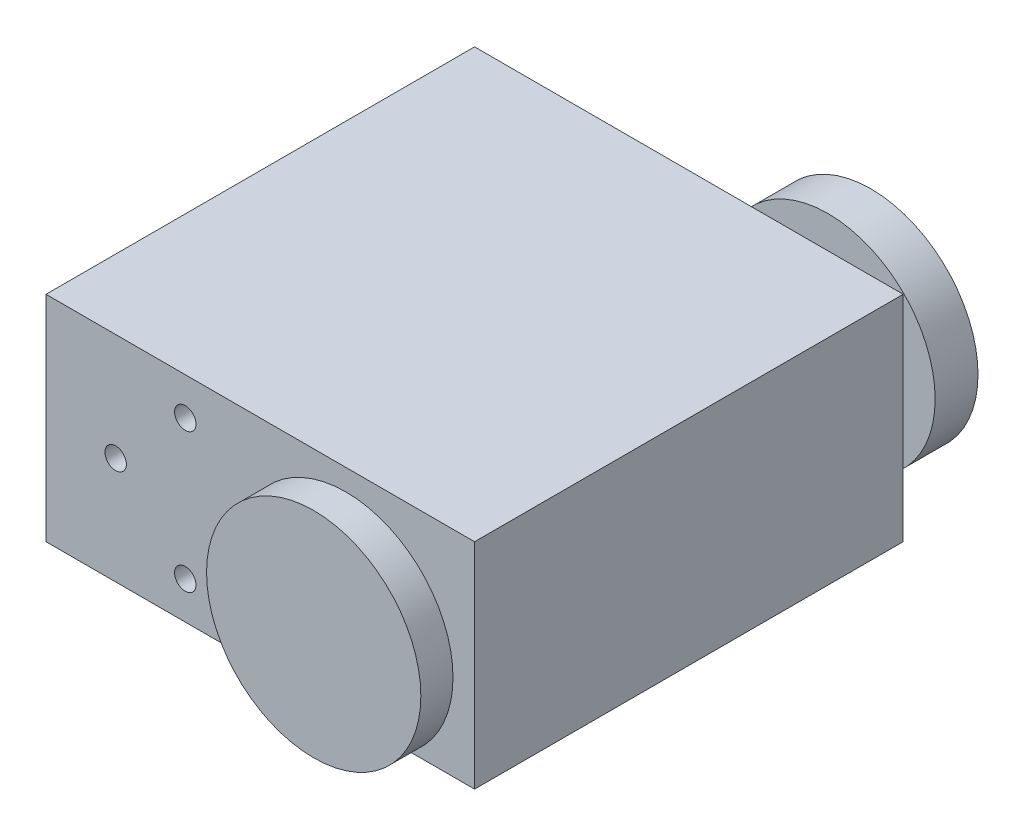
ISO-10303-21;
HEADER;
FILE_DESCRIPTION(('STEP AP214'),'2;1');
FILE_NAME('part.step','',(''),(''),'','','');
FILE_SCHEMA(('AUTOMOTIVE_DESIGN { 1 0 10303 214 1 1 1 1 }'));
ENDSEC;
DATA;
#1=APPLICATION_CONTEXT('core data for automotive mechanical design processes');
#2=APPLICATION_PROTOCOL_DEFINITION('international standard','automotive_design',2000,#1);
#3=PRODUCT_CONTEXT('',#1,'mechanical');
#4=PRODUCT('Part','Part','',(#3));
#5=PRODUCT_RELATED_PRODUCT_CATEGORY('part','',(#4));
#6=PRODUCT_DEFINITION_FORMATION('','',#4);
#7=PRODUCT_DEFINITION_CONTEXT('part definition',#1,'design');
#8=PRODUCT_DEFINITION('design','',#6,#7);
#9=PRODUCT_DEFINITION_SHAPE('','',#8);
#10=(LENGTH_UNIT() NAMED_UNIT(*) SI_UNIT(.MILLI.,.METRE.));
#11=(NAMED_UNIT(*) PLANE_ANGLE_UNIT() SI_UNIT($,.RADIAN.));
#12=(NAMED_UNIT(*) SI_UNIT($,.STERADIAN.) SOLID_ANGLE_UNIT());
#13=UNCERTAINTY_MEASURE_WITH_UNIT(LENGTH_MEASURE(1.E-05),#10,'distance_accuracy_value','');
#14=(GEOMETRIC_REPRESENTATION_CONTEXT(3) GLOBAL_UNCERTAINTY_ASSIGNED_CONTEXT((#13)) GLOBAL_UNIT_ASSIGNED_CONTEXT((#10,
#11,#12)) REPRESENTATION_CONTEXT('',''));
#15=CARTESIAN_POINT('',(0.,0.,0.));
#16=DIRECTION('',(0.,0.,1.));
#17=DIRECTION('',(1.,0.,0.));
#18=AXIS2_PLACEMENT_3D('',#15,#16,#17);
#19=CARTESIAN_POINT('',(0.,20.,0.));
#20=DIRECTION('',(1.,0.,0.));
#21=DIRECTION('',(0.,0.,-1.));
#22=AXIS2_PLACEMENT_3D('',#19,#20,#21);
#23=PLANE('',#22);
#24=DIRECTION('',(0.,0.,1.));
#25=VECTOR('',#24,1.);
#26=CARTESIAN_POINT('',(0.,0.,0.));
#27=LINE('',#26,#25);
#28=CARTESIAN_POINT('',(0.,0.,-40.));
#29=VERTEX_POINT('',#28);
#30=CARTESIAN_POINT('',(0.,0.,0.));
#31=VERTEX_POINT('',#30);
#32=EDGE_CURVE('E97',#29,#31,#27,.T.);
#33=ORIENTED_EDGE('',*,*,#32,.T.);
#34=DIRECTION('',(0.,-1.,0.));
#35=VECTOR('',#34,1.);
#36=CARTESIAN_POINT('',(0.,20.,0.));
#37=LINE('',#36,#35);
#38=CARTESIAN_POINT('',(0.,20.,0.));
#39=VERTEX_POINT('',#38);
#40=EDGE_CURVE('E11',#39,#31,#37,.T.);
#41=ORIENTED_EDGE('',*,*,#40,.F.);
#42=DIRECTION('',(0.,0.,1.));
#43=VECTOR('',#42,1.);
#44=CARTESIAN_POINT('',(0.,20.,0.));
#45=LINE('',#44,#43);
#46=CARTESIAN_POINT('',(0.,20.,-40.));
#47=VERTEX_POINT('',#46);
#48=EDGE_CURVE('E84',#47,#39,#45,.T.);
#49=ORIENTED_EDGE('',*,*,#48,.F.);
#50=DIRECTION('',(0.,-1.,0.));
#51=VECTOR('',#50,1.);
#52=CARTESIAN_POINT('',(0.,20.,-40.));
#53=LINE('',#52,#51);
#54=EDGE_CURVE('E93',#47,#29,#53,.T.);
#55=ORIENTED_EDGE('',*,*,#54,.T.);
#56=EDGE_LOOP('',(#33,#41,#49,#55));
#57=FACE_BOUND('',#56,.T.);
#58=ADVANCED_FACE('F32',(#57),#23,.F.);
#59=CARTESIAN_POINT('',(0.,20.,0.));
#60=DIRECTION('',(0.,0.,-1.));
#61=DIRECTION('',(-1.,0.,0.));
#62=AXIS2_PLACEMENT_3D('',#59,#60,#61);
#63=PLANE('',#62);
#64=CARTESIAN_POINT('',(13.,16.5,0.));
#65=DIRECTION('',(0.,0.,1.));
#66=DIRECTION('',(1.,0.,0.));
#67=AXIS2_PLACEMENT_3D('',#64,#65,#66);
#68=CIRCLE('',#67,1.);
#69=CARTESIAN_POINT('',(14.,16.5,0.));
#70=VERTEX_POINT('',#69);
#71=EDGE_CURVE('E174',#70,#70,#68,.T.);
#72=ORIENTED_EDGE('',*,*,#71,.F.);
#73=EDGE_LOOP('',(#72));
#74=FACE_BOUND('',#73,.T.);
#75=CARTESIAN_POINT('',(6.49999999999998,10.,0.));
#76=DIRECTION('',(0.,0.,1.));
#77=DIRECTION('',(1.,0.,0.));
#78=AXIS2_PLACEMENT_3D('',#75,#76,#77);
#79=CIRCLE('',#78,1.);
#80=CARTESIAN_POINT('',(7.49999999999998,10.,0.));
#81=VERTEX_POINT('',#80);
#82=EDGE_CURVE('E168',#81,#81,#79,.T.);
#83=ORIENTED_EDGE('',*,*,#82,.F.);
#84=EDGE_LOOP('',(#83));
#85=FACE_BOUND('',#84,.T.);
#86=CARTESIAN_POINT('',(13.,3.5,0.));
#87=DIRECTION('',(0.,0.,1.));
#88=DIRECTION('',(1.,0.,0.));
#89=AXIS2_PLACEMENT_3D('',#86,#87,#88);
#90=CIRCLE('',#89,1.);
#91=CARTESIAN_POINT('',(14.,3.5,0.));
#92=VERTEX_POINT('',#91);
#93=EDGE_CURVE('E162',#92,#92,#90,.T.);
#94=ORIENTED_EDGE('',*,*,#93,.F.);
#95=EDGE_LOOP('',(#94));
#96=FACE_BOUND('',#95,.T.);
#97=CARTESIAN_POINT('',(19.5,10.,0.));
#98=DIRECTION('',(0.,0.,1.));
#99=DIRECTION('',(1.,0.,0.));
#100=AXIS2_PLACEMENT_3D('',#97,#98,#99);
#101=CIRCLE('',#100,1.00000000000001);
#102=CARTESIAN_POINT('',(20.5,10.,0.));
#103=VERTEX_POINT('',#102);
#104=EDGE_CURVE('E156',#103,#103,#101,.T.);
#105=ORIENTED_EDGE('',*,*,#104,.F.);
#106=EDGE_LOOP('',(#105));
#107=FACE_BOUND('',#106,.T.);
#108=CARTESIAN_POINT('',(29.9853252116758,10.0202953764466,0.));
#109=DIRECTION('',(0.,0.,-1.));
#110=DIRECTION('',(-1.,0.,0.));
#111=AXIS2_PLACEMENT_3D('',#108,#109,#110);
#112=CIRCLE('',#111,4.);
#113=CARTESIAN_POINT('',(25.9853252116758,10.0202953764466,0.));
#114=VERTEX_POINT('',#113);
#115=EDGE_CURVE('E100',#114,#114,#112,.T.);
#116=ORIENTED_EDGE('',*,*,#115,.T.);
#117=EDGE_LOOP('',(#116));
#118=FACE_BOUND('',#117,.T.);
#119=DIRECTION('',(1.,0.,0.));
#120=VECTOR('',#119,1.);
#121=CARTESIAN_POINT('',(0.,0.,0.));
#122=LINE('',#121,#120);
#123=CARTESIAN_POINT('',(40.,0.,0.));
#124=VERTEX_POINT('',#123);
#125=EDGE_CURVE('E88',#31,#124,#122,.T.);
#126=ORIENTED_EDGE('',*,*,#125,.T.);
#127=DIRECTION('',(0.,-1.,0.));
#128=VECTOR('',#127,1.);
#129=CARTESIAN_POINT('',(40.,20.,0.));
#130=LINE('',#129,#128);
#131=CARTESIAN_POINT('',(40.,20.,0.));
#132=VERTEX_POINT('',#131);
#133=EDGE_CURVE('E41',#132,#124,#130,.T.);
#134=ORIENTED_EDGE('',*,*,#133,.F.);
#135=DIRECTION('',(1.,0.,0.));
#136=VECTOR('',#135,1.);
#137=CARTESIAN_POINT('',(0.,20.,0.));
#138=LINE('',#137,#136);
#139=EDGE_CURVE('E79',#39,#132,#138,.T.);
#140=ORIENTED_EDGE('',*,*,#139,.F.);
#141=ORIENTED_EDGE('',*,*,#40,.T.);
#142=EDGE_LOOP('',(#126,#134,#140,#141));
#143=FACE_BOUND('',#142,.T.);
#144=ADVANCED_FACE('F87',(#74,#85,#96,#107,#118,#143),#63,.F.);
#145=CARTESIAN_POINT('',(40.,20.,0.));
#146=DIRECTION('',(-1.,0.,0.));
#147=DIRECTION('',(0.,0.,1.));
#148=AXIS2_PLACEMENT_3D('',#145,#146,#147);
#149=PLANE('',#148);
#150=DIRECTION('',(0.,0.,-1.));
#151=VECTOR('',#150,1.);
#152=CARTESIAN_POINT('',(40.,0.,0.));
#153=LINE('',#152,#151);
#154=CARTESIAN_POINT('',(40.,0.,-40.));
#155=VERTEX_POINT('',#154);
#156=EDGE_CURVE('E66',#124,#155,#153,.T.);
#157=ORIENTED_EDGE('',*,*,#156,.T.);
#158=DIRECTION('',(0.,-1.,0.));
#159=VECTOR('',#158,1.);
#160=CARTESIAN_POINT('',(40.,20.,-40.));
#161=LINE('',#160,#159);
#162=CARTESIAN_POINT('',(40.,20.,-40.));
#163=VERTEX_POINT('',#162);
#164=EDGE_CURVE('E89',#163,#155,#161,.T.);
#165=ORIENTED_EDGE('',*,*,#164,.F.);
#166=DIRECTION('',(0.,0.,-1.));
#167=VECTOR('',#166,1.);
#168=CARTESIAN_POINT('',(40.,20.,0.));
#169=LINE('',#168,#167);
#170=EDGE_CURVE('E82',#132,#163,#169,.T.);
#171=ORIENTED_EDGE('',*,*,#170,.F.);
#172=ORIENTED_EDGE('',*,*,#133,.T.);
#173=EDGE_LOOP('',(#157,#165,#171,#172));
#174=FACE_BOUND('',#173,.T.);
#175=ADVANCED_FACE('F91',(#174),#149,.F.);
#176=CARTESIAN_POINT('',(0.,20.,-40.));
#177=DIRECTION('',(0.,0.,1.));
#178=DIRECTION('',(1.,0.,0.));
#179=AXIS2_PLACEMENT_3D('',#176,#177,#178);
#180=PLANE('',#179);
#181=CARTESIAN_POINT('',(21.,18.,-40.));
#182=DIRECTION('',(0.,0.,-1.));
#183=DIRECTION('',(-1.,0.,0.));
#184=AXIS2_PLACEMENT_3D('',#181,#182,#183);
#185=CIRCLE('',#184,1.);
#186=CARTESIAN_POINT('',(20.,18.,-40.));
#187=VERTEX_POINT('',#186);
#188=EDGE_CURVE('E138',#187,#187,#185,.T.);
#189=ORIENTED_EDGE('',*,*,#188,.F.);
#190=EDGE_LOOP('',(#189));
#191=FACE_BOUND('',#190,.T.);
#192=CARTESIAN_POINT('',(21.,2.,-40.));
#193=DIRECTION('',(0.,0.,-1.));
#194=DIRECTION('',(-1.,0.,0.));
#195=AXIS2_PLACEMENT_3D('',#192,#193,#194);
#196=CIRCLE('',#195,1.);
#197=CARTESIAN_POINT('',(20.,2.,-40.));
#198=VERTEX_POINT('',#197);
#199=EDGE_CURVE('E145',#198,#198,#196,.T.);
#200=ORIENTED_EDGE('',*,*,#199,.F.);
#201=EDGE_LOOP('',(#200));
#202=FACE_BOUND('',#201,.T.);
#203=CARTESIAN_POINT('',(5.00000000000002,2.,-40.));
#204=DIRECTION('',(0.,0.,-1.));
#205=DIRECTION('',(-1.,0.,0.));
#206=AXIS2_PLACEMENT_3D('',#203,#204,#205);
#207=CIRCLE('',#206,1.);
#208=CARTESIAN_POINT('',(4.00000000000002,2.,-40.));
#209=VERTEX_POINT('',#208);
#210=EDGE_CURVE('E151',#209,#209,#207,.T.);
#211=ORIENTED_EDGE('',*,*,#210,.F.);
#212=EDGE_LOOP('',(#211));
#213=FACE_BOUND('',#212,.T.);
#214=CARTESIAN_POINT('',(5.00000000000002,18.,-40.));
#215=DIRECTION('',(0.,0.,-1.));
#216=DIRECTION('',(-1.,0.,0.));
#217=AXIS2_PLACEMENT_3D('',#214,#215,#216);
#218=CIRCLE('',#217,1.);
#219=CARTESIAN_POINT('',(4.00000000000002,18.,-40.));
#220=VERTEX_POINT('',#219);
#221=EDGE_CURVE('E132',#220,#220,#218,.T.);
#222=ORIENTED_EDGE('',*,*,#221,.F.);
#223=EDGE_LOOP('',(#222));
#224=FACE_BOUND('',#223,.T.);
#225=CARTESIAN_POINT('',(29.9853252116758,10.0202953764466,-40.));
#226=DIRECTION('',(0.,0.,1.));
#227=DIRECTION('',(1.,0.,0.));
#228=AXIS2_PLACEMENT_3D('',#225,#226,#227);
#229=CIRCLE('',#228,4.);
#230=CARTESIAN_POINT('',(33.9853252116758,10.0202953764466,-40.));
#231=VERTEX_POINT('',#230);
#232=EDGE_CURVE('E35',#231,#231,#229,.T.);
#233=ORIENTED_EDGE('',*,*,#232,.T.);
#234=EDGE_LOOP('',(#233));
#235=FACE_BOUND('',#234,.T.);
#236=DIRECTION('',(-1.,0.,0.));
#237=VECTOR('',#236,1.);
#238=CARTESIAN_POINT('',(0.,0.,-40.));
#239=LINE('',#238,#237);
#240=EDGE_CURVE('E72',#155,#29,#239,.T.);
#241=ORIENTED_EDGE('',*,*,#240,.T.);
#242=ORIENTED_EDGE('',*,*,#54,.F.);
#243=DIRECTION('',(-1.,0.,0.));
#244=VECTOR('',#243,1.);
#245=CARTESIAN_POINT('',(0.,20.,-40.));
#246=LINE('',#245,#244);
#247=EDGE_CURVE('E49',#163,#47,#246,.T.);
#248=ORIENTED_EDGE('',*,*,#247,.F.);
#249=ORIENTED_EDGE('',*,*,#164,.T.);
#250=EDGE_LOOP('',(#241,#242,#248,#249));
#251=FACE_BOUND('',#250,.T.);
#252=ADVANCED_FACE('F105',(#191,#202,#213,#224,#235,#251),#180,.F.);
#253=CARTESIAN_POINT('',(0.,20.,0.));
#254=DIRECTION('',(0.,-1.,0.));
#255=DIRECTION('',(0.,0.,-1.));
#256=AXIS2_PLACEMENT_3D('',#253,#254,#255);
#257=PLANE('',#256);
#258=ORIENTED_EDGE('',*,*,#48,.T.);
#259=ORIENTED_EDGE('',*,*,#139,.T.);
#260=ORIENTED_EDGE('',*,*,#170,.T.);
#261=ORIENTED_EDGE('',*,*,#247,.T.);
#262=EDGE_LOOP('',(#258,#259,#260,#261));
#263=FACE_BOUND('',#262,.T.);
#264=ADVANCED_FACE('F80',(#263),#257,.F.);
#265=CARTESIAN_POINT('',(0.,0.,0.));
#266=DIRECTION('',(0.,-1.,0.));
#267=DIRECTION('',(0.,0.,-1.));
#268=AXIS2_PLACEMENT_3D('',#265,#266,#267);
#269=PLANE('',#268);
#270=ORIENTED_EDGE('',*,*,#32,.F.);
#271=ORIENTED_EDGE('',*,*,#240,.F.);
#272=ORIENTED_EDGE('',*,*,#156,.F.);
#273=ORIENTED_EDGE('',*,*,#125,.F.);
#274=EDGE_LOOP('',(#270,#271,#272,#273));
#275=FACE_BOUND('',#274,.T.);
#276=ADVANCED_FACE('F108',(#275),#269,.T.);
#277=CARTESIAN_POINT('',(29.9853252116758,10.0202953764466,-43.));
#278=DIRECTION('',(0.,0.,1.));
#279=DIRECTION('',(1.,0.,0.));
#280=AXIS2_PLACEMENT_3D('',#277,#278,#279);
#281=CYLINDRICAL_SURFACE('',#280,4.);
#282=CARTESIAN_POINT('',(29.9853252116758,10.0202953764466,-43.));
#283=DIRECTION('',(0.,0.,1.));
#284=DIRECTION('',(1.,0.,0.));
#285=AXIS2_PLACEMENT_3D('',#282,#283,#284);
#286=CIRCLE('',#285,4.);
#287=CARTESIAN_POINT('',(33.9853252116758,10.0202953764466,-43.));
#288=VERTEX_POINT('',#287);
#289=EDGE_CURVE('E113',#288,#288,#286,.T.);
#290=ORIENTED_EDGE('',*,*,#289,.T.);
#291=EDGE_LOOP('',(#290));
#292=FACE_BOUND('',#291,.T.);
#293=ORIENTED_EDGE('',*,*,#232,.F.);
#294=EDGE_LOOP('',(#293));
#295=FACE_BOUND('',#294,.T.);
#296=ADVANCED_FACE('F202',(#292,#295),#281,.T.);
#297=CARTESIAN_POINT('',(29.9853252116758,10.0202953764466,2.));
#298=DIRECTION('',(0.,0.,1.));
#299=DIRECTION('',(1.,0.,0.));
#300=AXIS2_PLACEMENT_3D('',#297,#298,#299);
#301=CIRCLE('',#300,4.);
#302=CARTESIAN_POINT('',(33.9853252116758,10.0202953764466,2.));
#303=VERTEX_POINT('',#302);
#304=EDGE_CURVE('E118',#303,#303,#301,.T.);
#305=ORIENTED_EDGE('',*,*,#304,.F.);
#306=EDGE_LOOP('',(#305));
#307=FACE_BOUND('',#306,.T.);
#308=ORIENTED_EDGE('',*,*,#115,.F.);
#309=EDGE_LOOP('',(#308));
#310=FACE_BOUND('',#309,.T.);
#311=ADVANCED_FACE('F199',(#307,#310),#281,.T.);
#312=CARTESIAN_POINT('',(29.9853252116758,10.0202953764466,5.));
#313=DIRECTION('',(0.,0.,-1.));
#314=DIRECTION('',(-1.,0.,0.));
#315=AXIS2_PLACEMENT_3D('',#312,#313,#314);
#316=CYLINDRICAL_SURFACE('',#315,10.);
#317=CARTESIAN_POINT('',(29.9853252116758,10.0202953764466,5.));
#318=DIRECTION('',(0.,0.,1.));
#319=DIRECTION('',(1.,0.,0.));
#320=AXIS2_PLACEMENT_3D('',#317,#318,#319);
#321=CIRCLE('',#320,10.);
#322=CARTESIAN_POINT('',(39.9853252116758,10.0202953764466,5.));
#323=VERTEX_POINT('',#322);
#324=EDGE_CURVE('E121',#323,#323,#321,.T.);
#325=ORIENTED_EDGE('',*,*,#324,.F.);
#326=EDGE_LOOP('',(#325));
#327=FACE_BOUND('',#326,.T.);
#328=CARTESIAN_POINT('',(29.9853252116758,10.0202953764466,2.));
#329=DIRECTION('',(0.,0.,1.));
#330=DIRECTION('',(1.,0.,0.));
#331=AXIS2_PLACEMENT_3D('',#328,#329,#330);
#332=CIRCLE('',#331,10.);
#333=CARTESIAN_POINT('',(39.9853252116758,10.0202953764466,2.));
#334=VERTEX_POINT('',#333);
#335=EDGE_CURVE('E116',#334,#334,#332,.T.);
#336=ORIENTED_EDGE('',*,*,#335,.T.);
#337=EDGE_LOOP('',(#336));
#338=FACE_BOUND('',#337,.T.);
#339=ADVANCED_FACE('F201',(#327,#338),#316,.T.);
#340=CARTESIAN_POINT('',(29.9853252116758,10.0202953764466,5.));
#341=DIRECTION('',(0.,0.,1.));
#342=DIRECTION('',(1.,0.,0.));
#343=AXIS2_PLACEMENT_3D('',#340,#341,#342);
#344=PLANE('',#343);
#345=ORIENTED_EDGE('',*,*,#324,.T.);
#346=EDGE_LOOP('',(#345));
#347=FACE_BOUND('',#346,.T.);
#348=ADVANCED_FACE('F209',(#347),#344,.T.);
#349=CARTESIAN_POINT('',(29.9853252116758,10.0202953764466,2.));
#350=DIRECTION('',(0.,0.,1.));
#351=DIRECTION('',(1.,0.,0.));
#352=AXIS2_PLACEMENT_3D('',#349,#350,#351);
#353=PLANE('',#352);
#354=ORIENTED_EDGE('',*,*,#304,.T.);
#355=EDGE_LOOP('',(#354));
#356=FACE_BOUND('',#355,.T.);
#357=ORIENTED_EDGE('',*,*,#335,.F.);
#358=EDGE_LOOP('',(#357));
#359=FACE_BOUND('',#358,.T.);
#360=ADVANCED_FACE('F273',(#356,#359),#353,.F.);
#361=CARTESIAN_POINT('',(29.9853252116758,10.0202953764466,-47.));
#362=DIRECTION('',(0.,0.,1.));
#363=DIRECTION('',(1.,0.,0.));
#364=AXIS2_PLACEMENT_3D('',#361,#362,#363);
#365=CYLINDRICAL_SURFACE('',#364,10.);
#366=CARTESIAN_POINT('',(29.9853252116758,10.0202953764466,-47.));
#367=DIRECTION('',(0.,0.,-1.));
#368=DIRECTION('',(-1.,0.,0.));
#369=AXIS2_PLACEMENT_3D('',#366,#367,#368);
#370=CIRCLE('',#369,10.);
#371=CARTESIAN_POINT('',(19.9853252116758,10.0202953764466,-47.));
#372=VERTEX_POINT('',#371);
#373=EDGE_CURVE('E117',#372,#372,#370,.T.);
#374=ORIENTED_EDGE('',*,*,#373,.F.);
#375=EDGE_LOOP('',(#374));
#376=FACE_BOUND('',#375,.T.);
#377=CARTESIAN_POINT('',(29.9853252116758,10.0202953764466,-43.));
#378=DIRECTION('',(0.,0.,-1.));
#379=DIRECTION('',(-1.,0.,0.));
#380=AXIS2_PLACEMENT_3D('',#377,#378,#379);
#381=CIRCLE('',#380,10.);
#382=CARTESIAN_POINT('',(19.9853252116758,10.0202953764466,-43.));
#383=VERTEX_POINT('',#382);
#384=EDGE_CURVE('E126',#383,#383,#381,.T.);
#385=ORIENTED_EDGE('',*,*,#384,.T.);
#386=EDGE_LOOP('',(#385));
#387=FACE_BOUND('',#386,.T.);
#388=ADVANCED_FACE('F283',(#376,#387),#365,.T.);
#389=CARTESIAN_POINT('',(29.9853252116758,10.0202953764466,-47.));
#390=DIRECTION('',(0.,0.,-1.));
#391=DIRECTION('',(-1.,0.,0.));
#392=AXIS2_PLACEMENT_3D('',#389,#390,#391);
#393=PLANE('',#392);
#394=ORIENTED_EDGE('',*,*,#373,.T.);
#395=EDGE_LOOP('',(#394));
#396=FACE_BOUND('',#395,.T.);
#397=ADVANCED_FACE('F293',(#396),#393,.T.);
#398=CARTESIAN_POINT('',(29.9853252116758,10.0202953764466,-43.));
#399=DIRECTION('',(0.,0.,-1.));
#400=DIRECTION('',(-1.,0.,0.));
#401=AXIS2_PLACEMENT_3D('',#398,#399,#400);
#402=PLANE('',#401);
#403=ORIENTED_EDGE('',*,*,#289,.F.);
#404=EDGE_LOOP('',(#403));
#405=FACE_BOUND('',#404,.T.);
#406=ORIENTED_EDGE('',*,*,#384,.F.);
#407=EDGE_LOOP('',(#406));
#408=FACE_BOUND('',#407,.T.);
#409=ADVANCED_FACE('F302',(#405,#408),#402,.F.);
#410=CARTESIAN_POINT('',(5.00000000000002,18.,-35.));
#411=DIRECTION('',(0.,0.,-1.));
#412=DIRECTION('',(-1.,0.,0.));
#413=AXIS2_PLACEMENT_3D('',#410,#411,#412);
#414=CYLINDRICAL_SURFACE('',#413,1.);
#415=CARTESIAN_POINT('',(5.00000000000002,18.,-35.));
#416=DIRECTION('',(0.,0.,-1.));
#417=DIRECTION('',(-1.,0.,0.));
#418=AXIS2_PLACEMENT_3D('',#415,#416,#417);
#419=CIRCLE('',#418,1.);
#420=CARTESIAN_POINT('',(4.00000000000002,18.,-35.));
#421=VERTEX_POINT('',#420);
#422=EDGE_CURVE('E129',#421,#421,#419,.T.);
#423=ORIENTED_EDGE('',*,*,#422,.F.);
#424=EDGE_LOOP('',(#423));
#425=FACE_BOUND('',#424,.T.);
#426=ORIENTED_EDGE('',*,*,#221,.T.);
#427=EDGE_LOOP('',(#426));
#428=FACE_BOUND('',#427,.T.);
#429=ADVANCED_FACE('F311',(#425,#428),#414,.F.);
#430=CARTESIAN_POINT('',(5.00000000000002,18.,-35.));
#431=DIRECTION('',(0.,0.,-1.));
#432=DIRECTION('',(-1.,0.,0.));
#433=AXIS2_PLACEMENT_3D('',#430,#431,#432);
#434=PLANE('',#433);
#435=ORIENTED_EDGE('',*,*,#422,.T.);
#436=EDGE_LOOP('',(#435));
#437=FACE_BOUND('',#436,.T.);
#438=ADVANCED_FACE('F321',(#437),#434,.T.);
#439=CARTESIAN_POINT('',(5.00000000000002,2.,-35.));
#440=DIRECTION('',(0.,0.,-1.));
#441=DIRECTION('',(-1.,0.,0.));
#442=AXIS2_PLACEMENT_3D('',#439,#440,#441);
#443=CYLINDRICAL_SURFACE('',#442,1.);
#444=CARTESIAN_POINT('',(5.00000000000002,2.,-35.));
#445=DIRECTION('',(0.,0.,-1.));
#446=DIRECTION('',(-1.,0.,0.));
#447=AXIS2_PLACEMENT_3D('',#444,#445,#446);
#448=CIRCLE('',#447,1.);
#449=CARTESIAN_POINT('',(4.00000000000002,2.,-35.));
#450=VERTEX_POINT('',#449);
#451=EDGE_CURVE('E135',#450,#450,#448,.T.);
#452=ORIENTED_EDGE('',*,*,#451,.F.);
#453=EDGE_LOOP('',(#452));
#454=FACE_BOUND('',#453,.T.);
#455=ORIENTED_EDGE('',*,*,#210,.T.);
#456=EDGE_LOOP('',(#455));
#457=FACE_BOUND('',#456,.T.);
#458=ADVANCED_FACE('F328',(#454,#457),#443,.F.);
#459=CARTESIAN_POINT('',(5.00000000000002,2.,-35.));
#460=DIRECTION('',(0.,0.,-1.));
#461=DIRECTION('',(-1.,0.,0.));
#462=AXIS2_PLACEMENT_3D('',#459,#460,#461);
#463=PLANE('',#462);
#464=ORIENTED_EDGE('',*,*,#451,.T.);
#465=EDGE_LOOP('',(#464));
#466=FACE_BOUND('',#465,.T.);
#467=ADVANCED_FACE('F336',(#466),#463,.T.);
#468=CARTESIAN_POINT('',(21.,2.,-35.));
#469=DIRECTION('',(0.,0.,-1.));
#470=DIRECTION('',(-1.,0.,0.));
#471=AXIS2_PLACEMENT_3D('',#468,#469,#470);
#472=CYLINDRICAL_SURFACE('',#471,1.);
#473=CARTESIAN_POINT('',(21.,2.,-35.));
#474=DIRECTION('',(0.,0.,-1.));
#475=DIRECTION('',(-1.,0.,0.));
#476=AXIS2_PLACEMENT_3D('',#473,#474,#475);
#477=CIRCLE('',#476,1.);
#478=CARTESIAN_POINT('',(20.,2.,-35.));
#479=VERTEX_POINT('',#478);
#480=EDGE_CURVE('E148',#479,#479,#477,.T.);
#481=ORIENTED_EDGE('',*,*,#480,.F.);
#482=EDGE_LOOP('',(#481));
#483=FACE_BOUND('',#482,.T.);
#484=ORIENTED_EDGE('',*,*,#199,.T.);
#485=EDGE_LOOP('',(#484));
#486=FACE_BOUND('',#485,.T.);
#487=ADVANCED_FACE('F344',(#483,#486),#472,.F.);
#488=CARTESIAN_POINT('',(21.,2.,-35.));
#489=DIRECTION('',(0.,0.,-1.));
#490=DIRECTION('',(-1.,0.,0.));
#491=AXIS2_PLACEMENT_3D('',#488,#489,#490);
#492=PLANE('',#491);
#493=ORIENTED_EDGE('',*,*,#480,.T.);
#494=EDGE_LOOP('',(#493));
#495=FACE_BOUND('',#494,.T.);
#496=ADVANCED_FACE('F352',(#495),#492,.T.);
#497=CARTESIAN_POINT('',(21.,18.,-35.));
#498=DIRECTION('',(0.,0.,-1.));
#499=DIRECTION('',(-1.,0.,0.));
#500=AXIS2_PLACEMENT_3D('',#497,#498,#499);
#501=CYLINDRICAL_SURFACE('',#500,1.);
#502=CARTESIAN_POINT('',(21.,18.,-35.));
#503=DIRECTION('',(0.,0.,-1.));
#504=DIRECTION('',(-1.,0.,0.));
#505=AXIS2_PLACEMENT_3D('',#502,#503,#504);
#506=CIRCLE('',#505,1.);
#507=CARTESIAN_POINT('',(20.,18.,-35.));
#508=VERTEX_POINT('',#507);
#509=EDGE_CURVE('E141',#508,#508,#506,.T.);
#510=ORIENTED_EDGE('',*,*,#509,.F.);
#511=EDGE_LOOP('',(#510));
#512=FACE_BOUND('',#511,.T.);
#513=ORIENTED_EDGE('',*,*,#188,.T.);
#514=EDGE_LOOP('',(#513));
#515=FACE_BOUND('',#514,.T.);
#516=ADVANCED_FACE('F360',(#512,#515),#501,.F.);
#517=CARTESIAN_POINT('',(21.,18.,-35.));
#518=DIRECTION('',(0.,0.,-1.));
#519=DIRECTION('',(-1.,0.,0.));
#520=AXIS2_PLACEMENT_3D('',#517,#518,#519);
#521=PLANE('',#520);
#522=ORIENTED_EDGE('',*,*,#509,.T.);
#523=EDGE_LOOP('',(#522));
#524=FACE_BOUND('',#523,.T.);
#525=ADVANCED_FACE('F368',(#524),#521,.T.);
#526=CARTESIAN_POINT('',(19.5,10.,-5.));
#527=DIRECTION('',(0.,0.,1.));
#528=DIRECTION('',(1.,0.,0.));
#529=AXIS2_PLACEMENT_3D('',#526,#527,#528);
#530=CYLINDRICAL_SURFACE('',#529,1.00000000000001);
#531=CARTESIAN_POINT('',(19.5,10.,-5.));
#532=DIRECTION('',(0.,0.,1.));
#533=DIRECTION('',(1.,0.,0.));
#534=AXIS2_PLACEMENT_3D('',#531,#532,#533);
#535=CIRCLE('',#534,1.00000000000001);
#536=CARTESIAN_POINT('',(20.5,10.,-5.));
#537=VERTEX_POINT('',#536);
#538=EDGE_CURVE('E159',#537,#537,#535,.T.);
#539=ORIENTED_EDGE('',*,*,#538,.F.);
#540=EDGE_LOOP('',(#539));
#541=FACE_BOUND('',#540,.T.);
#542=ORIENTED_EDGE('',*,*,#104,.T.);
#543=EDGE_LOOP('',(#542));
#544=FACE_BOUND('',#543,.T.);
#545=ADVANCED_FACE('F375',(#541,#544),#530,.F.);
#546=CARTESIAN_POINT('',(19.5,10.,-5.));
#547=DIRECTION('',(0.,0.,1.));
#548=DIRECTION('',(1.,0.,0.));
#549=AXIS2_PLACEMENT_3D('',#546,#547,#548);
#550=PLANE('',#549);
#551=ORIENTED_EDGE('',*,*,#538,.T.);
#552=EDGE_LOOP('',(#551));
#553=FACE_BOUND('',#552,.T.);
#554=ADVANCED_FACE('F382',(#553),#550,.T.);
#555=CARTESIAN_POINT('',(13.,3.5,-5.));
#556=DIRECTION('',(0.,0.,1.));
#557=DIRECTION('',(1.,0.,0.));
#558=AXIS2_PLACEMENT_3D('',#555,#556,#557);
#559=CYLINDRICAL_SURFACE('',#558,1.);
#560=CARTESIAN_POINT('',(13.,3.5,-5.));
#561=DIRECTION('',(0.,0.,1.));
#562=DIRECTION('',(1.,0.,0.));
#563=AXIS2_PLACEMENT_3D('',#560,#561,#562);
#564=CIRCLE('',#563,1.);
#565=CARTESIAN_POINT('',(14.,3.5,-5.));
#566=VERTEX_POINT('',#565);
#567=EDGE_CURVE('E165',#566,#566,#564,.T.);
#568=ORIENTED_EDGE('',*,*,#567,.F.);
#569=EDGE_LOOP('',(#568));
#570=FACE_BOUND('',#569,.T.);
#571=ORIENTED_EDGE('',*,*,#93,.T.);
#572=EDGE_LOOP('',(#571));
#573=FACE_BOUND('',#572,.T.);
#574=ADVANCED_FACE('F390',(#570,#573),#559,.F.);
#575=CARTESIAN_POINT('',(13.,3.5,-5.));
#576=DIRECTION('',(0.,0.,1.));
#577=DIRECTION('',(1.,0.,0.));
#578=AXIS2_PLACEMENT_3D('',#575,#576,#577);
#579=PLANE('',#578);
#580=ORIENTED_EDGE('',*,*,#567,.T.);
#581=EDGE_LOOP('',(#580));
#582=FACE_BOUND('',#581,.T.);
#583=ADVANCED_FACE('F398',(#582),#579,.T.);
#584=CARTESIAN_POINT('',(6.49999999999998,10.,-5.));
#585=DIRECTION('',(0.,0.,1.));
#586=DIRECTION('',(1.,0.,0.));
#587=AXIS2_PLACEMENT_3D('',#584,#585,#586);
#588=CYLINDRICAL_SURFACE('',#587,1.);
#589=CARTESIAN_POINT('',(6.49999999999998,10.,-5.));
#590=DIRECTION('',(0.,0.,1.));
#591=DIRECTION('',(1.,0.,0.));
#592=AXIS2_PLACEMENT_3D('',#589,#590,#591);
#593=CIRCLE('',#592,1.);
#594=CARTESIAN_POINT('',(7.49999999999998,10.,-5.));
#595=VERTEX_POINT('',#594);
#596=EDGE_CURVE('E171',#595,#595,#593,.T.);
#597=ORIENTED_EDGE('',*,*,#596,.F.);
#598=EDGE_LOOP('',(#597));
#599=FACE_BOUND('',#598,.T.);
#600=ORIENTED_EDGE('',*,*,#82,.T.);
#601=EDGE_LOOP('',(#600));
#602=FACE_BOUND('',#601,.T.);
#603=ADVANCED_FACE('F406',(#599,#602),#588,.F.);
#604=CARTESIAN_POINT('',(6.49999999999998,10.,-5.));
#605=DIRECTION('',(0.,0.,1.));
#606=DIRECTION('',(1.,0.,0.));
#607=AXIS2_PLACEMENT_3D('',#604,#605,#606);
#608=PLANE('',#607);
#609=ORIENTED_EDGE('',*,*,#596,.T.);
#610=EDGE_LOOP('',(#609));
#611=FACE_BOUND('',#610,.T.);
#612=ADVANCED_FACE('F185',(#611),#608,.T.);
#613=CARTESIAN_POINT('',(13.,16.5,-5.));
#614=DIRECTION('',(0.,0.,1.));
#615=DIRECTION('',(1.,0.,0.));
#616=AXIS2_PLACEMENT_3D('',#613,#614,#615);
#617=CYLINDRICAL_SURFACE('',#616,1.);
#618=CARTESIAN_POINT('',(13.,16.5,-5.));
#619=DIRECTION('',(0.,0.,1.));
#620=DIRECTION('',(1.,0.,0.));
#621=AXIS2_PLACEMENT_3D('',#618,#619,#620);
#622=CIRCLE('',#621,1.);
#623=CARTESIAN_POINT('',(14.,16.5,-5.));
#624=VERTEX_POINT('',#623);
#625=EDGE_CURVE('E142',#624,#624,#622,.T.);
#626=ORIENTED_EDGE('',*,*,#625,.F.);
#627=EDGE_LOOP('',(#626));
#628=FACE_BOUND('',#627,.T.);
#629=ORIENTED_EDGE('',*,*,#71,.T.);
#630=EDGE_LOOP('',(#629));
#631=FACE_BOUND('',#630,.T.);
#632=ADVANCED_FACE('F182',(#628,#631),#617,.F.);
#633=CARTESIAN_POINT('',(13.,16.5,-5.));
#634=DIRECTION('',(0.,0.,1.));
#635=DIRECTION('',(1.,0.,0.));
#636=AXIS2_PLACEMENT_3D('',#633,#634,#635);
#637=PLANE('',#636);
#638=ORIENTED_EDGE('',*,*,#625,.T.);
#639=EDGE_LOOP('',(#638));
#640=FACE_BOUND('',#639,.T.);
#641=ADVANCED_FACE('F180',(#640),#637,.T.);
#642=CLOSED_SHELL('',(#58,#144,#175,#252,#264,#276,#296,#311,#339,#348,#360,#388,#397,#409,#429,
#438,#458,#467,#487,#496,#516,#525,#545,#554,#574,#583,#603,#612,#632,#641));
#643=MANIFOLD_SOLID_BREP('B2',#642);
#644=ADVANCED_BREP_SHAPE_REPRESENTATION('',(#18,#643),#14);
#645=SHAPE_DEFINITION_REPRESENTATION(#9,#644);
ENDSEC;
END-ISO-10303-21;
